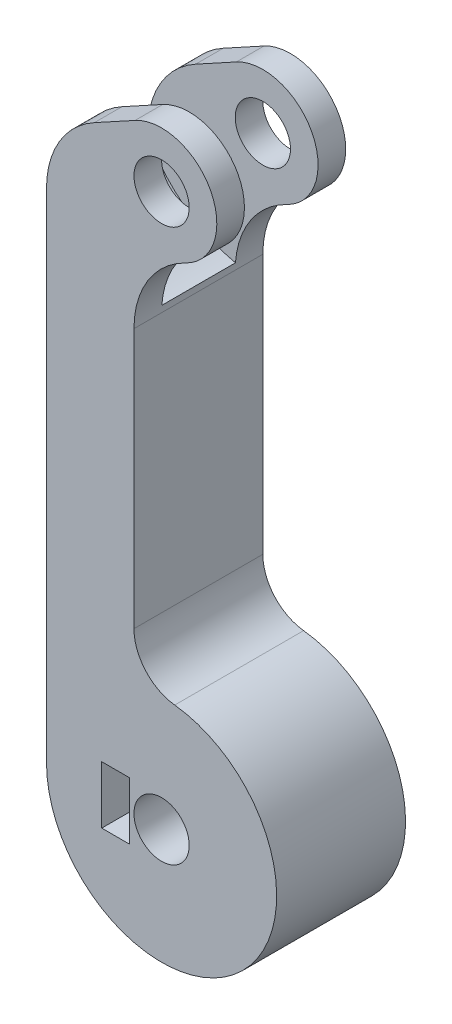
ISO-10303-21;
HEADER;
FILE_DESCRIPTION(('STEP AP214'),'2;1');
FILE_NAME('part.step','',(''),(''),'','','');
FILE_SCHEMA(('AUTOMOTIVE_DESIGN { 1 0 10303 214 1 1 1 1 }'));
ENDSEC;
DATA;
#1=APPLICATION_CONTEXT('core data for automotive mechanical design processes');
#2=APPLICATION_PROTOCOL_DEFINITION('international standard','automotive_design',2000,#1);
#3=PRODUCT_CONTEXT('',#1,'mechanical');
#4=PRODUCT('Part','Part','',(#3));
#5=PRODUCT_RELATED_PRODUCT_CATEGORY('part','',(#4));
#6=PRODUCT_DEFINITION_FORMATION('','',#4);
#7=PRODUCT_DEFINITION_CONTEXT('part definition',#1,'design');
#8=PRODUCT_DEFINITION('design','',#6,#7);
#9=PRODUCT_DEFINITION_SHAPE('','',#8);
#10=(LENGTH_UNIT() NAMED_UNIT(*) SI_UNIT(.MILLI.,.METRE.));
#11=(NAMED_UNIT(*) PLANE_ANGLE_UNIT() SI_UNIT($,.RADIAN.));
#12=(NAMED_UNIT(*) SI_UNIT($,.STERADIAN.) SOLID_ANGLE_UNIT());
#13=UNCERTAINTY_MEASURE_WITH_UNIT(LENGTH_MEASURE(1.E-05),#10,'distance_accuracy_value','');
#14=(GEOMETRIC_REPRESENTATION_CONTEXT(3) GLOBAL_UNCERTAINTY_ASSIGNED_CONTEXT((#13)) GLOBAL_UNIT_ASSIGNED_CONTEXT((#10,
#11,#12)) REPRESENTATION_CONTEXT('',''));
#15=CARTESIAN_POINT('',(0.,0.,0.));
#16=DIRECTION('',(0.,0.,1.));
#17=DIRECTION('',(1.,0.,0.));
#18=AXIS2_PLACEMENT_3D('',#15,#16,#17);
#19=CARTESIAN_POINT('',(-2.5,0.,7.));
#20=DIRECTION('',(-1.,0.,0.));
#21=DIRECTION('',(0.,-1.,0.));
#22=AXIS2_PLACEMENT_3D('',#19,#20,#21);
#23=CYLINDRICAL_SURFACE('',#22,1.5);
#24=CARTESIAN_POINT('',(-3.,0.,8.5));
#25=CARTESIAN_POINT('',(-2.99999570107562,-0.0788579444268502,8.49999504652421));
#26=CARTESIAN_POINT('',(-2.99685736529635,-0.157809899546344,8.49374489031842));
#27=CARTESIAN_POINT('',(-2.98461234055736,-0.313380352903344,8.46902067948769));
#28=CARTESIAN_POINT('',(-2.97549431743379,-0.389994130070444,8.45052341050328));
#29=CARTESIAN_POINT('',(-2.95224419105063,-0.538400317320674,8.40220928707506));
#30=CARTESIAN_POINT('',(-2.93813158766306,-0.61021020440872,8.37243642362805));
#31=CARTESIAN_POINT('',(-2.90618664773642,-0.747708925209899,8.30264406795252));
#32=CARTESIAN_POINT('',(-2.88835460450288,-0.813398240985089,8.2626253836267));
#33=CARTESIAN_POINT('',(-2.84934387387093,-0.941261726642864,8.17072412577207));
#34=CARTESIAN_POINT('',(-2.82802798691306,-1.00298281668316,8.11827028114054));
#35=CARTESIAN_POINT('',(-2.78489955370114,-1.11716916730047,8.00421778112944));
#36=CARTESIAN_POINT('',(-2.76308664313552,-1.16962737466015,7.94261222234134));
#37=CARTESIAN_POINT('',(-2.71948426796021,-1.26787800067542,7.80627497571493));
#38=CARTESIAN_POINT('',(-2.69782780455198,-1.31283800332746,7.73089585248113));
#39=CARTESIAN_POINT('',(-2.65928968158481,-1.38925234033604,7.57244899602068));
#40=CARTESIAN_POINT('',(-2.64240461410484,-1.4207163224495,7.48938680691588));
#41=CARTESIAN_POINT('',(-2.61686800556713,-1.46719866328288,7.32300234186712));
#42=CARTESIAN_POINT('',(-2.6077840737557,-1.48308878562066,7.23999332189891));
#43=CARTESIAN_POINT('',(-2.59772834922792,-1.50064048996327,7.07203174333078));
#44=CARTESIAN_POINT('',(-2.59674854014932,-1.50231613255961,6.98708118869327));
#45=CARTESIAN_POINT('',(-2.60266395385873,-1.49203093075844,6.82857096352695));
#46=CARTESIAN_POINT('',(-2.6086314549302,-1.48167683930523,6.75486395316543));
#47=CARTESIAN_POINT('',(-2.62614343100775,-1.4504097735854,6.61041713594044));
#48=CARTESIAN_POINT('',(-2.63768968247664,-1.42949343584648,6.53967828204203));
#49=CARTESIAN_POINT('',(-2.66531214619112,-1.37731467057901,6.40115630115151));
#50=CARTESIAN_POINT('',(-2.68148760995998,-1.34582260067399,6.33348040182132));
#51=CARTESIAN_POINT('',(-2.71655106422106,-1.273562531502,6.20404856111499));
#52=CARTESIAN_POINT('',(-2.73544027170286,-1.2327903657187,6.14229529659987));
#53=CARTESIAN_POINT('',(-2.77669736854929,-1.13709908236918,6.01821812088516));
#54=CARTESIAN_POINT('',(-2.79920265355119,-1.08104168755392,5.95681468963576));
#55=CARTESIAN_POINT('',(-2.84321434950611,-0.95933336811206,5.84389687211365));
#56=CARTESIAN_POINT('',(-2.86472027938201,-0.893677884861428,5.79238721194918));
#57=CARTESIAN_POINT('',(-2.90552980924446,-0.750774758747773,5.69847150845541));
#58=CARTESIAN_POINT('',(-2.92468476243011,-0.673130387399113,5.65659929133139));
#59=CARTESIAN_POINT('',(-2.95736821681863,-0.510699323233195,5.58685445643549));
#60=CARTESIAN_POINT('',(-2.9709011841533,-0.425918364397914,5.55897072247725));
#61=CARTESIAN_POINT('',(-2.98986500612153,-0.259149737491054,5.52028689442499));
#62=CARTESIAN_POINT('',(-2.99587407451965,-0.17751229582249,5.50826314637983));
#63=CARTESIAN_POINT('',(-3.00109520188655,-0.0131693999240282,5.49780290329827));
#64=CARTESIAN_POINT('',(-3.00031048081978,0.0695355298048626,5.4993599715408));
#65=CARTESIAN_POINT('',(-2.99236788380152,0.22684945797898,5.51531003262812));
#66=CARTESIAN_POINT('',(-2.98570868532252,0.301589112074895,5.52869879909499));
#67=CARTESIAN_POINT('',(-2.9673325697226,0.447610338452911,5.56635710784268));
#68=CARTESIAN_POINT('',(-2.95561509501618,0.51889152853663,5.59062784968024));
#69=CARTESIAN_POINT('',(-2.92776377120382,0.658332912674358,5.64999769964955));
#70=CARTESIAN_POINT('',(-2.91151322654446,0.726345595508704,5.68538657517443));
#71=CARTESIAN_POINT('',(-2.87615961476126,0.855692042548907,5.76566130346985));
#72=CARTESIAN_POINT('',(-2.85705533350407,0.917022944664887,5.81055120189309));
#73=CARTESIAN_POINT('',(-2.81562332004297,1.03765153393382,5.91364063799608));
#74=CARTESIAN_POINT('',(-2.79316327265249,1.09615811672854,5.97271430266772));
#75=CARTESIAN_POINT('',(-2.7489358741323,1.20278448167828,6.09988772691659));
#76=CARTESIAN_POINT('',(-2.72716901100071,1.25089707856781,6.16799367827188));
#77=CARTESIAN_POINT('',(-2.68576788309734,1.33756187171853,6.31546548125946));
#78=CARTESIAN_POINT('',(-2.66628794383591,1.37553824370037,6.39521689914172));
#79=CARTESIAN_POINT('',(-2.63361108441202,1.43712423890206,6.56126510136245));
#80=CARTESIAN_POINT('',(-2.62040607332625,1.46075237380052,6.64755328970034));
#81=CARTESIAN_POINT('',(-2.60342251538703,1.49079253120031,6.81536533432706));
#82=CARTESIAN_POINT('',(-2.59886075197597,1.49863949460818,6.89655138015286));
#83=CARTESIAN_POINT('',(-2.59748031962405,1.5010337315643,7.05917060074679));
#84=CARTESIAN_POINT('',(-2.60065829439585,1.49558676993486,7.14060365310679));
#85=CARTESIAN_POINT('',(-2.61356793076615,1.47288918838996,7.29322525230016));
#86=CARTESIAN_POINT('',(-2.62264641723988,1.45681247151455,7.36465070521711));
#87=CARTESIAN_POINT('',(-2.64556524281479,1.41476303733662,7.50371217913655));
#88=CARTESIAN_POINT('',(-2.65940711354503,1.38878713673988,7.57134697313805));
#89=CARTESIAN_POINT('',(-2.69142795546804,1.32572361795085,7.70593727647981));
#90=CARTESIAN_POINT('',(-2.70983583593881,1.28800670672355,7.77254185274354));
#91=CARTESIAN_POINT('',(-2.74852997452291,1.20322645745609,7.89891180427189));
#92=CARTESIAN_POINT('',(-2.76881720693416,1.15615825686234,7.95867359578167));
#93=CARTESIAN_POINT('',(-2.81193484737138,1.04730498999206,8.07721297353201));
#94=CARTESIAN_POINT('',(-2.83477474959942,0.984426634495891,8.13498865352544));
#95=CARTESIAN_POINT('',(-2.87816628389896,0.849232209349794,8.2393944751529));
#96=CARTESIAN_POINT('',(-2.89871667939293,0.776911084957794,8.28601860920486));
#97=CARTESIAN_POINT('',(-2.93547014349806,0.623897395174417,8.3668545440681));
#98=CARTESIAN_POINT('',(-2.95164144740899,0.543149255665094,8.4009762538547));
#99=CARTESIAN_POINT('',(-2.9775201194848,0.376113151707129,8.45471225163611));
#100=CARTESIAN_POINT('',(-2.98724585044602,0.289841699383649,8.47436777020857));
#101=CARTESIAN_POINT('',(-2.99543192870217,0.168902919736342,8.49084611662861));
#102=CARTESIAN_POINT('',(-2.99714048010376,0.135242819162346,8.49427396129951));
#103=CARTESIAN_POINT('',(-2.99942545465223,0.0677275977076369,8.49885199827113));
#104=CARTESIAN_POINT('',(-3.00000184655071,0.0338724714699424,8.50000212770531));
#105=CARTESIAN_POINT('',(-3.,0.,8.5));
#106=B_SPLINE_CURVE_WITH_KNOTS('',3,(#24,#25,#26,#27,#28,#29,#30,#31,#32,#33,#34,#35,#36,#37,
#38,#39,#40,#41,#42,#43,#44,#45,#46,#47,#48,#49,#50,#51,#52,#53,#54,#55,#56,#57,#58,#59,#60,#61,
#62,#63,#64,#65,#66,#67,#68,#69,#70,#71,#72,#73,#74,#75,#76,#77,#78,#79,#80,#81,#82,#83,#84,#85,
#86,#87,#88,#89,#90,#91,#92,#93,#94,#95,#96,#97,#98,#99,#100,#101,#102,#103,#104,#105),
.UNSPECIFIED.,.T.,.F.,(4,2,2,2,2,2,2,2,2,2,2,2,2,2,2,2,2,2,2,2,2,2,2,2,2,2,2,2,2,2,2,2,2,2,2,2,
2,2,2,2,4),(0.,0.236436386130439,0.473322224563796,0.709293233238449,0.945245640872352,
1.19547263807713,1.44588935648105,1.71572589646129,1.98536921847421,2.23887018210344,
2.49212035993531,2.71508568613981,2.93812205888518,3.16635360252731,3.39468781890333,
3.65197412000818,3.90938301898029,4.17874533321661,4.44789325368419,4.69474935707018,
4.94148846767214,5.16910359759183,5.39674382446397,5.63089284041848,5.86514176122509,
6.12239415966628,6.37982382923148,6.64972023242588,6.91926767918176,7.1629396125457,
7.40650589797017,7.62686895373283,7.84730293182526,8.08254685170431,8.31791341715446,
8.58187864135757,8.84598575071869,9.1119602049529,9.37717362931724,9.47872920200875,
9.58028757766599),.UNSPECIFIED.);
#107=CARTESIAN_POINT('',(-3.,0.,8.5));
#108=VERTEX_POINT('',#107);
#109=EDGE_CURVE('E223',#108,#108,#106,.T.);
#110=ORIENTED_EDGE('',*,*,#109,.T.);
#111=EDGE_LOOP('',(#110));
#112=FACE_BOUND('',#111,.T.);
#113=CARTESIAN_POINT('',(-3.5,0.,7.));
#114=DIRECTION('',(-1.,0.,0.));
#115=DIRECTION('',(0.,0.,1.));
#116=AXIS2_PLACEMENT_3D('',#113,#114,#115);
#117=CIRCLE('',#116,1.5);
#118=CARTESIAN_POINT('',(-3.5,0.,8.5));
#119=VERTEX_POINT('',#118);
#120=EDGE_CURVE('E202',#119,#119,#117,.F.);
#121=ORIENTED_EDGE('',*,*,#120,.F.);
#122=EDGE_LOOP('',(#121));
#123=FACE_BOUND('',#122,.T.);
#124=ADVANCED_FACE('F35',(#112,#123),#23,.F.);
#125=CARTESIAN_POINT('',(0.,0.,14.));
#126=DIRECTION('',(0.,0.,1.));
#127=DIRECTION('',(1.,0.,0.));
#128=AXIS2_PLACEMENT_3D('',#125,#126,#127);
#129=PLANE('',#128);
#130=DIRECTION('',(0.877268487978452,0.48,0.));
#131=VECTOR('',#130,1.);
#132=CARTESIAN_POINT('',(-28.1453324537794,51.4396109278707,14.));
#133=LINE('',#132,#131);
#134=CARTESIAN_POINT('',(-7.3,62.8451950961463,14.));
#135=VERTEX_POINT('',#134);
#136=CARTESIAN_POINT('',(-2.88,65.2636109278707,14.));
#137=VERTEX_POINT('',#136);
#138=EDGE_CURVE('E261',#135,#137,#133,.T.);
#139=ORIENTED_EDGE('',*,*,#138,.F.);
#140=CARTESIAN_POINT('',(-2.5,54.0725102163618,14.));
#141=DIRECTION('',(0.,0.,1.));
#142=DIRECTION('',(1.,0.,0.));
#143=AXIS2_PLACEMENT_3D('',#140,#141,#142);
#144=CIRCLE('',#143,10.);
#145=CARTESIAN_POINT('',(-12.5,54.0725102163618,14.));
#146=VERTEX_POINT('',#145);
#147=EDGE_CURVE('E308',#135,#146,#144,.T.);
#148=ORIENTED_EDGE('',*,*,#147,.T.);
#149=DIRECTION('',(0.,-1.,0.));
#150=VECTOR('',#149,1.);
#151=CARTESIAN_POINT('',(-12.5,0.,14.));
#152=LINE('',#151,#150);
#153=CARTESIAN_POINT('',(-12.5,0.,14.));
#154=VERTEX_POINT('',#153);
#155=EDGE_CURVE('E264',#146,#154,#152,.T.);
#156=ORIENTED_EDGE('',*,*,#155,.T.);
#157=CARTESIAN_POINT('',(0.,0.,14.));
#158=DIRECTION('',(0.,0.,1.));
#159=DIRECTION('',(1.,0.,0.));
#160=AXIS2_PLACEMENT_3D('',#157,#158,#159);
#161=CIRCLE('',#160,12.5);
#162=CARTESIAN_POINT('',(1.42857142857143,12.4180990362241,14.));
#163=VERTEX_POINT('',#162);
#164=EDGE_CURVE('E253',#154,#163,#161,.T.);
#165=ORIENTED_EDGE('',*,*,#164,.T.);
#166=CARTESIAN_POINT('',(2.,17.3853386507137,14.));
#167=DIRECTION('',(0.,0.,1.));
#168=DIRECTION('',(1.,0.,0.));
#169=AXIS2_PLACEMENT_3D('',#166,#167,#168);
#170=CIRCLE('',#169,5.);
#171=CARTESIAN_POINT('',(-3.,17.3853386507137,14.));
#172=VERTEX_POINT('',#171);
#173=EDGE_CURVE('E329',#163,#172,#170,.F.);
#174=ORIENTED_EDGE('',*,*,#173,.T.);
#175=DIRECTION('',(0.,1.,0.));
#176=VECTOR('',#175,1.);
#177=CARTESIAN_POINT('',(-3.,0.,14.));
#178=LINE('',#177,#176);
#179=CARTESIAN_POINT('',(-3.,45.6125054300618,14.));
#180=VERTEX_POINT('',#179);
#181=EDGE_CURVE('E256',#172,#180,#178,.T.);
#182=ORIENTED_EDGE('',*,*,#181,.T.);
#183=CARTESIAN_POINT('',(7.,45.6125054300618,14.));
#184=DIRECTION('',(0.,0.,1.));
#185=DIRECTION('',(1.,0.,0.));
#186=AXIS2_PLACEMENT_3D('',#183,#184,#185);
#187=CIRCLE('',#186,10.);
#188=CARTESIAN_POINT('',(2.625,54.6046895362732,14.));
#189=VERTEX_POINT('',#188);
#190=EDGE_CURVE('E320',#180,#189,#187,.F.);
#191=ORIENTED_EDGE('',*,*,#190,.T.);
#192=CARTESIAN_POINT('',(0.,60.,14.));
#193=DIRECTION('',(0.,0.,1.));
#194=DIRECTION('',(1.,0.,0.));
#195=AXIS2_PLACEMENT_3D('',#192,#193,#194);
#196=CIRCLE('',#195,6.);
#197=EDGE_CURVE('E259',#189,#137,#196,.T.);
#198=ORIENTED_EDGE('',*,*,#197,.T.);
#199=EDGE_LOOP('',(#139,#148,#156,#165,#174,#182,#191,#198));
#200=FACE_BOUND('',#199,.T.);
#201=CARTESIAN_POINT('',(0.,60.,14.));
#202=DIRECTION('',(0.,0.,1.));
#203=DIRECTION('',(1.,0.,0.));
#204=AXIS2_PLACEMENT_3D('',#201,#202,#203);
#205=CIRCLE('',#204,3.);
#206=CARTESIAN_POINT('',(3.,60.,14.));
#207=VERTEX_POINT('',#206);
#208=EDGE_CURVE('E266',#207,#207,#205,.T.);
#209=ORIENTED_EDGE('',*,*,#208,.F.);
#210=EDGE_LOOP('',(#209));
#211=FACE_BOUND('',#210,.T.);
#212=CARTESIAN_POINT('',(0.,0.,14.));
#213=DIRECTION('',(0.,0.,1.));
#214=DIRECTION('',(1.,0.,0.));
#215=AXIS2_PLACEMENT_3D('',#212,#213,#214);
#216=CIRCLE('',#215,3.);
#217=CARTESIAN_POINT('',(3.,0.,14.));
#218=VERTEX_POINT('',#217);
#219=EDGE_CURVE('E269',#218,#218,#216,.T.);
#220=ORIENTED_EDGE('',*,*,#219,.F.);
#221=EDGE_LOOP('',(#220));
#222=FACE_BOUND('',#221,.T.);
#223=DIRECTION('',(-1.,0.,0.));
#224=VECTOR('',#223,1.);
#225=CARTESIAN_POINT('',(-3.5,3.12500000000003,14.));
#226=LINE('',#225,#224);
#227=CARTESIAN_POINT('',(-3.5,3.12500000000003,14.));
#228=VERTEX_POINT('',#227);
#229=CARTESIAN_POINT('',(-6.5,3.12500000000003,14.));
#230=VERTEX_POINT('',#229);
#231=EDGE_CURVE('E194',#228,#230,#226,.T.);
#232=ORIENTED_EDGE('',*,*,#231,.F.);
#233=DIRECTION('',(0.,-1.,0.));
#234=VECTOR('',#233,1.);
#235=CARTESIAN_POINT('',(-3.5,0.,14.));
#236=LINE('',#235,#234);
#237=CARTESIAN_POINT('',(-3.5,-3.12500000000003,14.));
#238=VERTEX_POINT('',#237);
#239=EDGE_CURVE('E178',#228,#238,#236,.T.);
#240=ORIENTED_EDGE('',*,*,#239,.T.);
#241=DIRECTION('',(-1.,0.,0.));
#242=VECTOR('',#241,1.);
#243=CARTESIAN_POINT('',(-3.5,-3.12500000000003,14.));
#244=LINE('',#243,#242);
#245=CARTESIAN_POINT('',(-6.5,-3.12500000000003,14.));
#246=VERTEX_POINT('',#245);
#247=EDGE_CURVE('E215',#238,#246,#244,.T.);
#248=ORIENTED_EDGE('',*,*,#247,.T.);
#249=DIRECTION('',(0.,-1.,0.));
#250=VECTOR('',#249,1.);
#251=CARTESIAN_POINT('',(-6.5,0.,14.));
#252=LINE('',#251,#250);
#253=EDGE_CURVE('E201',#230,#246,#252,.T.);
#254=ORIENTED_EDGE('',*,*,#253,.F.);
#255=EDGE_LOOP('',(#232,#240,#248,#254));
#256=FACE_BOUND('',#255,.T.);
#257=ADVANCED_FACE('F200',(#200,#211,#222,#256),#129,.T.);
#258=CARTESIAN_POINT('',(-6.5,0.,7.));
#259=DIRECTION('',(-1.,0.,0.));
#260=DIRECTION('',(0.,0.,1.));
#261=AXIS2_PLACEMENT_3D('',#258,#259,#260);
#262=CIRCLE('',#261,1.5);
#263=CARTESIAN_POINT('',(-6.5,0.,8.5));
#264=VERTEX_POINT('',#263);
#265=EDGE_CURVE('E190',#264,#264,#262,.F.);
#266=ORIENTED_EDGE('',*,*,#265,.T.);
#267=EDGE_LOOP('',(#266));
#268=FACE_BOUND('',#267,.T.);
#269=CARTESIAN_POINT('',(-9.5,0.,7.));
#270=DIRECTION('',(-1.,0.,0.));
#271=DIRECTION('',(0.,-1.,0.));
#272=AXIS2_PLACEMENT_3D('',#269,#270,#271);
#273=CIRCLE('',#272,1.5);
#274=CARTESIAN_POINT('',(-9.5,-1.5,7.));
#275=VERTEX_POINT('',#274);
#276=EDGE_CURVE('E213',#275,#275,#273,.F.);
#277=ORIENTED_EDGE('',*,*,#276,.F.);
#278=EDGE_LOOP('',(#277));
#279=FACE_BOUND('',#278,.T.);
#280=ADVANCED_FACE('F347',(#268,#279),#23,.F.);
#281=CARTESIAN_POINT('',(0.,60.,14.));
#282=DIRECTION('',(0.,0.,-1.));
#283=DIRECTION('',(-1.,0.,0.));
#284=AXIS2_PLACEMENT_3D('',#281,#282,#283);
#285=CYLINDRICAL_SURFACE('',#284,6.);
#286=CARTESIAN_POINT('',(0.,60.,3.));
#287=DIRECTION('',(0.,0.,1.));
#288=DIRECTION('',(1.,0.,0.));
#289=AXIS2_PLACEMENT_3D('',#286,#287,#288);
#290=CIRCLE('',#289,6.);
#291=CARTESIAN_POINT('',(2.625,54.6046895362732,3.));
#292=VERTEX_POINT('',#291);
#293=CARTESIAN_POINT('',(-2.88,65.2636109278707,3.));
#294=VERTEX_POINT('',#293);
#295=EDGE_CURVE('E236',#292,#294,#290,.T.);
#296=ORIENTED_EDGE('',*,*,#295,.F.);
#297=DIRECTION('',(0.,0.,-1.));
#298=VECTOR('',#297,1.);
#299=CARTESIAN_POINT('',(2.625,54.6046895362732,14.));
#300=LINE('',#299,#298);
#301=CARTESIAN_POINT('',(2.625,54.6046895362732,0.));
#302=VERTEX_POINT('',#301);
#303=EDGE_CURVE('E310',#292,#302,#300,.T.);
#304=ORIENTED_EDGE('',*,*,#303,.T.);
#305=CARTESIAN_POINT('',(0.,60.,0.));
#306=DIRECTION('',(0.,0.,1.));
#307=DIRECTION('',(1.,0.,0.));
#308=AXIS2_PLACEMENT_3D('',#305,#306,#307);
#309=CIRCLE('',#308,6.);
#310=CARTESIAN_POINT('',(-2.88,65.2636109278707,0.));
#311=VERTEX_POINT('',#310);
#312=EDGE_CURVE('E277',#302,#311,#309,.T.);
#313=ORIENTED_EDGE('',*,*,#312,.T.);
#314=DIRECTION('',(0.,0.,-1.));
#315=VECTOR('',#314,1.);
#316=CARTESIAN_POINT('',(-2.88,65.2636109278707,14.));
#317=LINE('',#316,#315);
#318=EDGE_CURVE('E294',#294,#311,#317,.T.);
#319=ORIENTED_EDGE('',*,*,#318,.F.);
#320=EDGE_LOOP('',(#296,#304,#313,#319));
#321=FACE_BOUND('',#320,.T.);
#322=ADVANCED_FACE('F351',(#321),#285,.T.);
#323=CARTESIAN_POINT('',(-28.1453324537794,51.4396109278707,14.));
#324=DIRECTION('',(-0.48,0.877268487978452,0.));
#325=DIRECTION('',(-0.877268487978452,-0.48,0.));
#326=AXIS2_PLACEMENT_3D('',#323,#324,#325);
#327=PLANE('',#326);
#328=DIRECTION('',(0.,0.,-1.));
#329=VECTOR('',#328,1.);
#330=CARTESIAN_POINT('',(-7.3,62.8451950961463,14.));
#331=LINE('',#330,#329);
#332=CARTESIAN_POINT('',(-7.3,62.8451950961463,0.));
#333=VERTEX_POINT('',#332);
#334=CARTESIAN_POINT('',(-7.29999999999999,62.8451950961463,3.));
#335=VERTEX_POINT('',#334);
#336=EDGE_CURVE('E305',#333,#335,#331,.F.);
#337=ORIENTED_EDGE('',*,*,#336,.T.);
#338=DIRECTION('',(0.877268487978452,0.48,0.));
#339=VECTOR('',#338,1.);
#340=CARTESIAN_POINT('',(-28.1453324537794,51.4396109278707,3.));
#341=LINE('',#340,#339);
#342=EDGE_CURVE('E238',#335,#294,#341,.T.);
#343=ORIENTED_EDGE('',*,*,#342,.T.);
#344=ORIENTED_EDGE('',*,*,#318,.T.);
#345=DIRECTION('',(0.877268487978452,0.48,0.));
#346=VECTOR('',#345,1.);
#347=CARTESIAN_POINT('',(-28.1453324537794,51.4396109278707,0.));
#348=LINE('',#347,#346);
#349=EDGE_CURVE('E280',#333,#311,#348,.T.);
#350=ORIENTED_EDGE('',*,*,#349,.F.);
#351=EDGE_LOOP('',(#337,#343,#344,#350));
#352=FACE_BOUND('',#351,.T.);
#353=ADVANCED_FACE('F565',(#352),#327,.T.);
#354=CARTESIAN_POINT('',(0.,60.,14.));
#355=DIRECTION('',(0.,0.,-1.));
#356=DIRECTION('',(-1.,0.,0.));
#357=AXIS2_PLACEMENT_3D('',#354,#355,#356);
#358=CYLINDRICAL_SURFACE('',#357,3.);
#359=CARTESIAN_POINT('',(0.,60.,0.));
#360=DIRECTION('',(0.,0.,1.));
#361=DIRECTION('',(1.,0.,0.));
#362=AXIS2_PLACEMENT_3D('',#359,#360,#361);
#363=CIRCLE('',#362,3.);
#364=CARTESIAN_POINT('',(3.,60.,0.));
#365=VERTEX_POINT('',#364);
#366=EDGE_CURVE('E286',#365,#365,#363,.T.);
#367=ORIENTED_EDGE('',*,*,#366,.F.);
#368=EDGE_LOOP('',(#367));
#369=FACE_BOUND('',#368,.T.);
#370=CARTESIAN_POINT('',(0.,60.,3.));
#371=DIRECTION('',(0.,0.,1.));
#372=DIRECTION('',(1.,0.,0.));
#373=AXIS2_PLACEMENT_3D('',#370,#371,#372);
#374=CIRCLE('',#373,3.);
#375=CARTESIAN_POINT('',(3.,60.,3.));
#376=VERTEX_POINT('',#375);
#377=EDGE_CURVE('E246',#376,#376,#374,.T.);
#378=ORIENTED_EDGE('',*,*,#377,.T.);
#379=EDGE_LOOP('',(#378));
#380=FACE_BOUND('',#379,.T.);
#381=ADVANCED_FACE('F553',(#369,#380),#358,.F.);
#382=CARTESIAN_POINT('',(-12.5,0.,14.));
#383=DIRECTION('',(1.,0.,0.));
#384=DIRECTION('',(0.,1.,0.));
#385=AXIS2_PLACEMENT_3D('',#382,#383,#384);
#386=PLANE('',#385);
#387=DIRECTION('',(0.,0.,-1.));
#388=VECTOR('',#387,1.);
#389=CARTESIAN_POINT('',(-12.5,0.,14.));
#390=LINE('',#389,#388);
#391=CARTESIAN_POINT('',(-12.5,0.,2.));
#392=VERTEX_POINT('',#391);
#393=CARTESIAN_POINT('',(-12.5,0.,0.));
#394=VERTEX_POINT('',#393);
#395=EDGE_CURVE('E272',#392,#394,#390,.T.);
#396=ORIENTED_EDGE('',*,*,#395,.F.);
#397=CARTESIAN_POINT('',(-12.5,0.,7.));
#398=DIRECTION('',(-1.,0.,0.));
#399=DIRECTION('',(0.,-1.,0.));
#400=AXIS2_PLACEMENT_3D('',#397,#398,#399);
#401=CIRCLE('',#400,5.);
#402=CARTESIAN_POINT('',(-12.5,0.,12.));
#403=VERTEX_POINT('',#402);
#404=EDGE_CURVE('E62',#403,#392,#401,.T.);
#405=ORIENTED_EDGE('',*,*,#404,.F.);
#406=EDGE_CURVE('E291',#154,#403,#390,.T.);
#407=ORIENTED_EDGE('',*,*,#406,.F.);
#408=ORIENTED_EDGE('',*,*,#155,.F.);
#409=DIRECTION('',(0.,0.,-1.));
#410=VECTOR('',#409,1.);
#411=CARTESIAN_POINT('',(-12.5,54.0725102163618,0.));
#412=LINE('',#411,#410);
#413=CARTESIAN_POINT('',(-12.5,54.0725102163618,11.));
#414=VERTEX_POINT('',#413);
#415=EDGE_CURVE('E299',#146,#414,#412,.T.);
#416=ORIENTED_EDGE('',*,*,#415,.T.);
#417=DIRECTION('',(0.,-1.,0.));
#418=VECTOR('',#417,1.);
#419=CARTESIAN_POINT('',(-12.5,0.,11.));
#420=LINE('',#419,#418);
#421=CARTESIAN_POINT('',(-12.5,53.6952398935408,11.));
#422=VERTEX_POINT('',#421);
#423=EDGE_CURVE('E230',#414,#422,#420,.T.);
#424=ORIENTED_EDGE('',*,*,#423,.T.);
#425=DIRECTION('',(0.,0.,1.));
#426=VECTOR('',#425,1.);
#427=CARTESIAN_POINT('',(-12.5,53.6952398935408,3.));
#428=LINE('',#427,#426);
#429=CARTESIAN_POINT('',(-12.5,53.6952398935408,3.));
#430=VERTEX_POINT('',#429);
#431=EDGE_CURVE('E249',#422,#430,#428,.F.);
#432=ORIENTED_EDGE('',*,*,#431,.T.);
#433=DIRECTION('',(0.,-1.,0.));
#434=VECTOR('',#433,1.);
#435=CARTESIAN_POINT('',(-12.5,0.,3.));
#436=LINE('',#435,#434);
#437=CARTESIAN_POINT('',(-12.5,54.0725102163618,3.));
#438=VERTEX_POINT('',#437);
#439=EDGE_CURVE('E244',#438,#430,#436,.T.);
#440=ORIENTED_EDGE('',*,*,#439,.F.);
#441=CARTESIAN_POINT('',(-12.5,54.0725102163618,0.));
#442=VERTEX_POINT('',#441);
#443=EDGE_CURVE('E298',#438,#442,#412,.T.);
#444=ORIENTED_EDGE('',*,*,#443,.T.);
#445=DIRECTION('',(0.,-1.,0.));
#446=VECTOR('',#445,1.);
#447=CARTESIAN_POINT('',(-12.5,0.,0.));
#448=LINE('',#447,#446);
#449=EDGE_CURVE('E283',#442,#394,#448,.T.);
#450=ORIENTED_EDGE('',*,*,#449,.T.);
#451=EDGE_LOOP('',(#396,#405,#407,#408,#416,#424,#432,#440,#444,#450));
#452=FACE_BOUND('',#451,.T.);
#453=ADVANCED_FACE('F596',(#452),#386,.F.);
#454=CARTESIAN_POINT('',(-2.5,54.0725102163618,14.));
#455=DIRECTION('',(0.,0.,1.));
#456=DIRECTION('',(1.,0.,0.));
#457=AXIS2_PLACEMENT_3D('',#454,#455,#456);
#458=CYLINDRICAL_SURFACE('',#457,10.);
#459=ORIENTED_EDGE('',*,*,#443,.F.);
#460=CARTESIAN_POINT('',(-2.5,54.0725102163618,3.));
#461=DIRECTION('',(0.,0.,1.));
#462=DIRECTION('',(1.,0.,0.));
#463=AXIS2_PLACEMENT_3D('',#460,#461,#462);
#464=CIRCLE('',#463,10.);
#465=EDGE_CURVE('E241',#438,#335,#464,.F.);
#466=ORIENTED_EDGE('',*,*,#465,.T.);
#467=ORIENTED_EDGE('',*,*,#336,.F.);
#468=CARTESIAN_POINT('',(-2.5,54.0725102163618,0.));
#469=DIRECTION('',(0.,0.,1.));
#470=DIRECTION('',(1.,0.,0.));
#471=AXIS2_PLACEMENT_3D('',#468,#469,#470);
#472=CIRCLE('',#471,10.);
#473=EDGE_CURVE('E302',#442,#333,#472,.F.);
#474=ORIENTED_EDGE('',*,*,#473,.F.);
#475=EDGE_LOOP('',(#459,#466,#467,#474));
#476=FACE_BOUND('',#475,.T.);
#477=ADVANCED_FACE('F380',(#476),#458,.T.);
#478=CARTESIAN_POINT('',(7.,45.6125054300618,14.));
#479=DIRECTION('',(0.,0.,-1.));
#480=DIRECTION('',(-1.,0.,0.));
#481=AXIS2_PLACEMENT_3D('',#478,#479,#480);
#482=CYLINDRICAL_SURFACE('',#481,10.);
#483=CARTESIAN_POINT('',(7.,45.6125054300618,3.));
#484=DIRECTION('',(0.,0.,1.));
#485=DIRECTION('',(1.,0.,0.));
#486=AXIS2_PLACEMENT_3D('',#483,#484,#485);
#487=CIRCLE('',#486,10.);
#488=CARTESIAN_POINT('',(-2.9749598714857,46.3197363416106,3.));
#489=VERTEX_POINT('',#488);
#490=EDGE_CURVE('E48',#489,#292,#487,.F.);
#491=ORIENTED_EDGE('',*,*,#490,.F.);
#492=DIRECTION('',(0.,0.,1.));
#493=VECTOR('',#492,1.);
#494=CARTESIAN_POINT('',(-2.9749598714857,46.3197363416106,7.));
#495=LINE('',#494,#493);
#496=CARTESIAN_POINT('',(-2.9749598714857,46.3197363416106,11.));
#497=VERTEX_POINT('',#496);
#498=EDGE_CURVE('E334',#489,#497,#495,.T.);
#499=ORIENTED_EDGE('',*,*,#498,.T.);
#500=CARTESIAN_POINT('',(7.,45.6125054300618,11.));
#501=DIRECTION('',(0.,0.,1.));
#502=DIRECTION('',(1.,0.,0.));
#503=AXIS2_PLACEMENT_3D('',#500,#501,#502);
#504=CIRCLE('',#503,10.);
#505=CARTESIAN_POINT('',(2.625,54.6046895362732,11.));
#506=VERTEX_POINT('',#505);
#507=EDGE_CURVE('E331',#497,#506,#504,.F.);
#508=ORIENTED_EDGE('',*,*,#507,.T.);
#509=EDGE_CURVE('E311',#189,#506,#300,.T.);
#510=ORIENTED_EDGE('',*,*,#509,.F.);
#511=ORIENTED_EDGE('',*,*,#190,.F.);
#512=DIRECTION('',(0.,0.,1.));
#513=VECTOR('',#512,1.);
#514=CARTESIAN_POINT('',(-3.,45.6125054300618,14.));
#515=LINE('',#514,#513);
#516=CARTESIAN_POINT('',(-3.,45.6125054300618,0.));
#517=VERTEX_POINT('',#516);
#518=EDGE_CURVE('E314',#517,#180,#515,.T.);
#519=ORIENTED_EDGE('',*,*,#518,.F.);
#520=CARTESIAN_POINT('',(7.,45.6125054300618,0.));
#521=DIRECTION('',(0.,0.,1.));
#522=DIRECTION('',(1.,0.,0.));
#523=AXIS2_PLACEMENT_3D('',#520,#521,#522);
#524=CIRCLE('',#523,10.);
#525=EDGE_CURVE('E317',#302,#517,#524,.T.);
#526=ORIENTED_EDGE('',*,*,#525,.F.);
#527=ORIENTED_EDGE('',*,*,#303,.F.);
#528=EDGE_LOOP('',(#491,#499,#508,#510,#511,#519,#526,#527));
#529=FACE_BOUND('',#528,.T.);
#530=ADVANCED_FACE('F581',(#529),#482,.F.);
#531=CARTESIAN_POINT('',(0.,0.,14.));
#532=DIRECTION('',(0.,0.,-1.));
#533=DIRECTION('',(-1.,0.,0.));
#534=AXIS2_PLACEMENT_3D('',#531,#532,#533);
#535=CYLINDRICAL_SURFACE('',#534,12.5);
#536=ORIENTED_EDGE('',*,*,#406,.T.);
#537=CARTESIAN_POINT('',(-12.5,0.,12.));
#538=CARTESIAN_POINT('',(-12.500020800684,-0.134949308996274,12.0000202081202));
#539=CARTESIAN_POINT('',(-12.4978153957144,-0.269889445051977,11.9945375022852));
#540=CARTESIAN_POINT('',(-12.489104501459,-0.53871066429344,11.9727171797796));
#541=CARTESIAN_POINT('',(-12.4826002859457,-0.672592049307616,11.9563827785468));
#542=CARTESIAN_POINT('',(-12.4654733400566,-0.937880643793604,11.9130841683113));
#543=CARTESIAN_POINT('',(-12.4548648060412,-1.06929476209466,11.8861565945196));
#544=CARTESIAN_POINT('',(-12.4298142661668,-1.32919381894715,11.8219458218481));
#545=CARTESIAN_POINT('',(-12.4153721065972,-1.45767863982299,11.7846622077363));
#546=CARTESIAN_POINT('',(-12.3830371412335,-1.71074349111272,11.7001204058065));
#547=CARTESIAN_POINT('',(-12.3651475954467,-1.83532708233301,11.6528716375409));
#548=CARTESIAN_POINT('',(-12.3263603625027,-2.07995512816273,11.5487893664004));
#549=CARTESIAN_POINT('',(-12.305461551723,-2.19999786603811,11.4919522819998));
#550=CARTESIAN_POINT('',(-12.2389837385988,-2.55229640076871,11.3076579554153));
#551=CARTESIAN_POINT('',(-12.1896127431099,-2.77680181017457,11.1663909491314));
#552=CARTESIAN_POINT('',(-12.0832664924134,-3.20880030935443,10.8443958586704));
#553=CARTESIAN_POINT('',(-12.0260574468794,-3.4151671301424,10.662247568058));
#554=CARTESIAN_POINT('',(-11.9115017033706,-3.79546821071738,10.2664419108347));
#555=CARTESIAN_POINT('',(-11.8541549616113,-3.96939020702375,10.0527726843802));
#556=CARTESIAN_POINT('',(-11.7714354046385,-4.20603647838614,9.70739277182154));
#557=CARTESIAN_POINT('',(-11.7438616590436,-4.28222354403732,9.58521766855821));
#558=CARTESIAN_POINT('',(-11.6912025131309,-4.42396777333364,9.33435881417283));
#559=CARTESIAN_POINT('',(-11.6661160911756,-4.48952930836457,9.20567776835347));
#560=CARTESIAN_POINT('',(-11.6192518077079,-4.60946194967609,8.94261803683486));
#561=CARTESIAN_POINT('',(-11.5974741020936,-4.66383252871047,8.8082390830462));
#562=CARTESIAN_POINT('',(-11.5579968261789,-4.76082481749917,8.53478857434898));
#563=CARTESIAN_POINT('',(-11.540295219536,-4.80345239593476,8.39571940257148));
#564=CARTESIAN_POINT('',(-11.5103010427642,-4.8748746809749,8.12023520600168));
#565=CARTESIAN_POINT('',(-11.4978012422802,-4.90420468010106,7.98398150679508));
#566=CARTESIAN_POINT('',(-11.4775530418261,-4.95140770700266,7.70921206798286));
#567=CARTESIAN_POINT('',(-11.4698024965028,-4.96928590799763,7.57069737879456));
#568=CARTESIAN_POINT('',(-11.4593296133055,-4.99338947016272,7.29249397310081));
#569=CARTESIAN_POINT('',(-11.4566063172897,-4.99961705182375,7.15280548540847));
#570=CARTESIAN_POINT('',(-11.4562871379012,-5.00034862390723,6.87339536184991));
#571=CARTESIAN_POINT('',(-11.4586910154291,-4.99485316101917,6.73367372783325));
#572=CARTESIAN_POINT('',(-11.4681901273893,-4.97300130092477,6.4650946500387));
#573=CARTESIAN_POINT('',(-11.4749457840337,-4.95743071779699,6.33616031960835));
#574=CARTESIAN_POINT('',(-11.4925995806655,-4.9163659139183,6.08012882343619));
#575=CARTESIAN_POINT('',(-11.5034990839794,-4.89086842714742,5.95303227662596));
#576=CARTESIAN_POINT('',(-11.5291035207104,-4.83020236032039,5.70159296674975));
#577=CARTESIAN_POINT('',(-11.5438074730664,-4.7950362733804,5.57724950270114));
#578=CARTESIAN_POINT('',(-11.5765842944584,-4.7153519685607,5.33203609660907));
#579=CARTESIAN_POINT('',(-11.5946584578651,-4.67083015666429,5.21116750978904));
#580=CARTESIAN_POINT('',(-11.6539747379485,-4.52178204947661,4.85010139425016));
#581=CARTESIAN_POINT('',(-11.6997804109224,-4.40296543798373,4.61636927967778));
#582=CARTESIAN_POINT('',(-11.7984560330086,-4.13125297805196,4.17142234632085));
#583=CARTESIAN_POINT('',(-11.8513286997704,-3.97834400402712,3.96021624649368));
#584=CARTESIAN_POINT('',(-11.9631625736754,-3.62890183055985,3.54900486480799));
#585=CARTESIAN_POINT('',(-12.0222786301683,-3.42991144740135,3.35112458787171));
#586=CARTESIAN_POINT('',(-12.1364954090928,-3.00076790048644,2.99078406595519));
#587=CARTESIAN_POINT('',(-12.1915948638257,-2.77060496315566,2.82833497162943));
#588=CARTESIAN_POINT('',(-12.2673288544486,-2.40390629799307,2.61343668849912));
#589=CARTESIAN_POINT('',(-12.2916358574032,-2.2766604796445,2.54605623097672));
#590=CARTESIAN_POINT('',(-12.3370030588955,-2.01637401415009,2.42234065214828));
#591=CARTESIAN_POINT('',(-12.35806464147,-1.88333586840904,2.36600081967366));
#592=CARTESIAN_POINT('',(-12.3963064620939,-1.61253473583468,2.26496034325046));
#593=CARTESIAN_POINT('',(-12.4134907396409,-1.47477684020628,2.22024757838093));
#594=CARTESIAN_POINT('',(-12.4434913892399,-1.19551142860325,2.14286700346893));
#595=CARTESIAN_POINT('',(-12.4563096094147,-1.05400552654081,2.11019409655416));
#596=CARTESIAN_POINT('',(-12.4777045849554,-0.761202648433835,2.05593234220772));
#597=CARTESIAN_POINT('',(-12.486037678861,-0.609769523376454,2.03497819171445));
#598=CARTESIAN_POINT('',(-12.4972000952862,-0.305560981969258,2.00700142663273));
#599=CARTESIAN_POINT('',(-12.5000343505931,-0.152786892266489,1.9999663257114));
#600=CARTESIAN_POINT('',(-12.5,0.,2.));
#601=B_SPLINE_CURVE_WITH_KNOTS('',3,(#537,#538,#539,#540,#541,#542,#543,#544,#545,#546,#547,
#548,#549,#550,#551,#552,#553,#554,#555,#556,#557,#558,#559,#560,#561,#562,#563,#564,#565,#566,
#567,#568,#569,#570,#571,#572,#573,#574,#575,#576,#577,#578,#579,#580,#581,#582,#583,#584,#585,
#586,#587,#588,#589,#590,#591,#592,#593,#594,#595,#596,#597,#598,#599,#600),.UNSPECIFIED.,.F.,
.F.,(4,2,2,2,2,2,2,2,2,2,2,2,2,2,2,2,2,2,2,2,2,2,2,2,2,2,2,2,2,2,2,4),(0.,0.404704249299301,
0.809288635181336,1.21248594453223,1.61569942266767,2.01853345826748,2.42151829908201,
3.2272379512382,4.06715005376468,4.90737898548698,5.34672317980212,5.7858861648059,
6.22506983562525,6.66403362020614,7.08328204248776,7.50234094024844,7.9213199614569,
8.34027944453119,8.72996144574503,9.11977176352431,9.50948166010491,9.89934153894409,
10.6941712026682,11.489307406468,12.3458562011329,13.2026741751284,13.6402682967348,
14.077675283071,14.5146244390387,14.9513884068144,15.4099544017599,15.8681088450084),.UNSPECIFIED.);
#602=EDGE_CURVE('E11',#403,#392,#601,.T.);
#603=ORIENTED_EDGE('',*,*,#602,.T.);
#604=ORIENTED_EDGE('',*,*,#395,.T.);
#605=CARTESIAN_POINT('',(0.,0.,0.));
#606=DIRECTION('',(0.,0.,1.));
#607=DIRECTION('',(1.,0.,0.));
#608=AXIS2_PLACEMENT_3D('',#605,#606,#607);
#609=CIRCLE('',#608,12.5);
#610=CARTESIAN_POINT('',(1.42857142857143,12.4180990362241,0.));
#611=VERTEX_POINT('',#610);
#612=EDGE_CURVE('E252',#394,#611,#609,.T.);
#613=ORIENTED_EDGE('',*,*,#612,.T.);
#614=DIRECTION('',(0.,0.,-1.));
#615=VECTOR('',#614,1.);
#616=CARTESIAN_POINT('',(1.42857142857143,12.4180990362241,14.));
#617=LINE('',#616,#615);
#618=EDGE_CURVE('E325',#611,#163,#617,.F.);
#619=ORIENTED_EDGE('',*,*,#618,.T.);
#620=ORIENTED_EDGE('',*,*,#164,.F.);
#621=EDGE_LOOP('',(#536,#603,#604,#613,#619,#620));
#622=FACE_BOUND('',#621,.T.);
#623=ADVANCED_FACE('F586',(#622),#535,.T.);
#624=CARTESIAN_POINT('',(-3.,0.,14.));
#625=DIRECTION('',(-1.,0.,0.));
#626=DIRECTION('',(0.,-1.,0.));
#627=AXIS2_PLACEMENT_3D('',#624,#625,#626);
#628=PLANE('',#627);
#629=ORIENTED_EDGE('',*,*,#181,.F.);
#630=DIRECTION('',(0.,0.,1.));
#631=VECTOR('',#630,1.);
#632=CARTESIAN_POINT('',(-3.,17.3853386507137,0.));
#633=LINE('',#632,#631);
#634=CARTESIAN_POINT('',(-3.,17.3853386507137,0.));
#635=VERTEX_POINT('',#634);
#636=EDGE_CURVE('E322',#172,#635,#633,.F.);
#637=ORIENTED_EDGE('',*,*,#636,.T.);
#638=DIRECTION('',(0.,1.,0.));
#639=VECTOR('',#638,1.);
#640=CARTESIAN_POINT('',(-3.,0.,0.));
#641=LINE('',#640,#639);
#642=EDGE_CURVE('E275',#635,#517,#641,.T.);
#643=ORIENTED_EDGE('',*,*,#642,.T.);
#644=ORIENTED_EDGE('',*,*,#518,.T.);
#645=EDGE_LOOP('',(#629,#637,#643,#644));
#646=FACE_BOUND('',#645,.T.);
#647=ADVANCED_FACE('F573',(#646),#628,.F.);
#648=ORIENTED_EDGE('',*,*,#509,.T.);
#649=CARTESIAN_POINT('',(0.,60.,11.));
#650=DIRECTION('',(0.,0.,1.));
#651=DIRECTION('',(1.,0.,0.));
#652=AXIS2_PLACEMENT_3D('',#649,#650,#651);
#653=CIRCLE('',#652,6.);
#654=CARTESIAN_POINT('',(-2.88,65.2636109278707,11.));
#655=VERTEX_POINT('',#654);
#656=EDGE_CURVE('E219',#506,#655,#653,.T.);
#657=ORIENTED_EDGE('',*,*,#656,.T.);
#658=EDGE_CURVE('E295',#137,#655,#317,.T.);
#659=ORIENTED_EDGE('',*,*,#658,.F.);
#660=ORIENTED_EDGE('',*,*,#197,.F.);
#661=EDGE_LOOP('',(#648,#657,#659,#660));
#662=FACE_BOUND('',#661,.T.);
#663=ADVANCED_FACE('F562',(#662),#285,.T.);
#664=DIRECTION('',(0.877268487978452,0.48,0.));
#665=VECTOR('',#664,1.);
#666=CARTESIAN_POINT('',(-28.1453324537794,51.4396109278707,11.));
#667=LINE('',#666,#665);
#668=CARTESIAN_POINT('',(-7.29999999999999,62.8451950961463,11.));
#669=VERTEX_POINT('',#668);
#670=EDGE_CURVE('E226',#669,#655,#667,.T.);
#671=ORIENTED_EDGE('',*,*,#670,.F.);
#672=EDGE_CURVE('E304',#669,#135,#331,.F.);
#673=ORIENTED_EDGE('',*,*,#672,.T.);
#674=ORIENTED_EDGE('',*,*,#138,.T.);
#675=ORIENTED_EDGE('',*,*,#658,.T.);
#676=EDGE_LOOP('',(#671,#673,#674,#675));
#677=FACE_BOUND('',#676,.T.);
#678=ADVANCED_FACE('F551',(#677),#327,.T.);
#679=CARTESIAN_POINT('',(0.,60.,11.));
#680=DIRECTION('',(0.,0.,1.));
#681=DIRECTION('',(1.,0.,0.));
#682=AXIS2_PLACEMENT_3D('',#679,#680,#681);
#683=CIRCLE('',#682,3.);
#684=CARTESIAN_POINT('',(3.,60.,11.));
#685=VERTEX_POINT('',#684);
#686=EDGE_CURVE('E233',#685,#685,#683,.T.);
#687=ORIENTED_EDGE('',*,*,#686,.F.);
#688=EDGE_LOOP('',(#687));
#689=FACE_BOUND('',#688,.T.);
#690=ORIENTED_EDGE('',*,*,#208,.T.);
#691=EDGE_LOOP('',(#690));
#692=FACE_BOUND('',#691,.T.);
#693=ADVANCED_FACE('F382',(#689,#692),#358,.F.);
#694=CARTESIAN_POINT('',(0.,0.,14.));
#695=DIRECTION('',(0.,0.,-1.));
#696=DIRECTION('',(-1.,0.,0.));
#697=AXIS2_PLACEMENT_3D('',#694,#695,#696);
#698=CYLINDRICAL_SURFACE('',#697,3.);
#699=ORIENTED_EDGE('',*,*,#109,.F.);
#700=EDGE_LOOP('',(#699));
#701=FACE_BOUND('',#700,.T.);
#702=ORIENTED_EDGE('',*,*,#219,.T.);
#703=EDGE_LOOP('',(#702));
#704=FACE_BOUND('',#703,.T.);
#705=CARTESIAN_POINT('',(0.,0.,0.));
#706=DIRECTION('',(0.,0.,1.));
#707=DIRECTION('',(1.,0.,0.));
#708=AXIS2_PLACEMENT_3D('',#705,#706,#707);
#709=CIRCLE('',#708,3.);
#710=CARTESIAN_POINT('',(3.,0.,0.));
#711=VERTEX_POINT('',#710);
#712=EDGE_CURVE('E257',#711,#711,#709,.T.);
#713=ORIENTED_EDGE('',*,*,#712,.F.);
#714=EDGE_LOOP('',(#713));
#715=FACE_BOUND('',#714,.T.);
#716=ADVANCED_FACE('F343',(#701,#704,#715),#698,.F.);
#717=CARTESIAN_POINT('',(0.,0.,0.));
#718=DIRECTION('',(0.,0.,1.));
#719=DIRECTION('',(1.,0.,0.));
#720=AXIS2_PLACEMENT_3D('',#717,#718,#719);
#721=PLANE('',#720);
#722=ORIENTED_EDGE('',*,*,#449,.F.);
#723=ORIENTED_EDGE('',*,*,#473,.T.);
#724=ORIENTED_EDGE('',*,*,#349,.T.);
#725=ORIENTED_EDGE('',*,*,#312,.F.);
#726=ORIENTED_EDGE('',*,*,#525,.T.);
#727=ORIENTED_EDGE('',*,*,#642,.F.);
#728=CARTESIAN_POINT('',(2.,17.3853386507137,0.));
#729=DIRECTION('',(0.,0.,1.));
#730=DIRECTION('',(1.,0.,0.));
#731=AXIS2_PLACEMENT_3D('',#728,#729,#730);
#732=CIRCLE('',#731,5.);
#733=EDGE_CURVE('E327',#635,#611,#732,.T.);
#734=ORIENTED_EDGE('',*,*,#733,.T.);
#735=ORIENTED_EDGE('',*,*,#612,.F.);
#736=EDGE_LOOP('',(#722,#723,#724,#725,#726,#727,#734,#735));
#737=FACE_BOUND('',#736,.T.);
#738=ORIENTED_EDGE('',*,*,#366,.T.);
#739=EDGE_LOOP('',(#738));
#740=FACE_BOUND('',#739,.T.);
#741=ORIENTED_EDGE('',*,*,#712,.T.);
#742=EDGE_LOOP('',(#741));
#743=FACE_BOUND('',#742,.T.);
#744=ADVANCED_FACE('F370',(#737,#740,#743),#721,.F.);
#745=CARTESIAN_POINT('',(-2.5,54.0725102163618,11.));
#746=DIRECTION('',(0.,0.,1.));
#747=DIRECTION('',(1.,0.,0.));
#748=AXIS2_PLACEMENT_3D('',#745,#746,#747);
#749=CIRCLE('',#748,10.);
#750=EDGE_CURVE('E228',#414,#669,#749,.F.);
#751=ORIENTED_EDGE('',*,*,#750,.F.);
#752=ORIENTED_EDGE('',*,*,#415,.F.);
#753=ORIENTED_EDGE('',*,*,#147,.F.);
#754=ORIENTED_EDGE('',*,*,#672,.F.);
#755=EDGE_LOOP('',(#751,#752,#753,#754));
#756=FACE_BOUND('',#755,.T.);
#757=ADVANCED_FACE('F372',(#756),#458,.T.);
#758=CARTESIAN_POINT('',(2.,17.3853386507137,14.));
#759=DIRECTION('',(0.,0.,-1.));
#760=DIRECTION('',(-1.,0.,0.));
#761=AXIS2_PLACEMENT_3D('',#758,#759,#760);
#762=CYLINDRICAL_SURFACE('',#761,5.);
#763=ORIENTED_EDGE('',*,*,#173,.F.);
#764=ORIENTED_EDGE('',*,*,#618,.F.);
#765=ORIENTED_EDGE('',*,*,#733,.F.);
#766=ORIENTED_EDGE('',*,*,#636,.F.);
#767=EDGE_LOOP('',(#763,#764,#765,#766));
#768=FACE_BOUND('',#767,.T.);
#769=ADVANCED_FACE('F37',(#768),#762,.F.);
#770=CARTESIAN_POINT('',(0.,60.,3.));
#771=DIRECTION('',(0.,0.,1.));
#772=DIRECTION('',(1.,0.,0.));
#773=AXIS2_PLACEMENT_3D('',#770,#771,#772);
#774=CYLINDRICAL_SURFACE('',#773,14.);
#775=CARTESIAN_POINT('',(0.,60.,11.));
#776=DIRECTION('',(0.,0.,1.));
#777=DIRECTION('',(1.,0.,0.));
#778=AXIS2_PLACEMENT_3D('',#775,#776,#777);
#779=CIRCLE('',#778,14.);
#780=EDGE_CURVE('E220',#422,#497,#779,.T.);
#781=ORIENTED_EDGE('',*,*,#780,.T.);
#782=ORIENTED_EDGE('',*,*,#498,.F.);
#783=CARTESIAN_POINT('',(0.,60.,3.));
#784=DIRECTION('',(0.,0.,1.));
#785=DIRECTION('',(1.,0.,0.));
#786=AXIS2_PLACEMENT_3D('',#783,#784,#785);
#787=CIRCLE('',#786,14.);
#788=EDGE_CURVE('E216',#430,#489,#787,.T.);
#789=ORIENTED_EDGE('',*,*,#788,.F.);
#790=ORIENTED_EDGE('',*,*,#431,.F.);
#791=EDGE_LOOP('',(#781,#782,#789,#790));
#792=FACE_BOUND('',#791,.T.);
#793=ADVANCED_FACE('F360',(#792),#774,.F.);
#794=CARTESIAN_POINT('',(0.,60.,3.));
#795=DIRECTION('',(0.,0.,1.));
#796=DIRECTION('',(1.,0.,0.));
#797=AXIS2_PLACEMENT_3D('',#794,#795,#796);
#798=PLANE('',#797);
#799=ORIENTED_EDGE('',*,*,#377,.F.);
#800=EDGE_LOOP('',(#799));
#801=FACE_BOUND('',#800,.T.);
#802=ORIENTED_EDGE('',*,*,#439,.T.);
#803=ORIENTED_EDGE('',*,*,#788,.T.);
#804=ORIENTED_EDGE('',*,*,#490,.T.);
#805=ORIENTED_EDGE('',*,*,#295,.T.);
#806=ORIENTED_EDGE('',*,*,#342,.F.);
#807=ORIENTED_EDGE('',*,*,#465,.F.);
#808=EDGE_LOOP('',(#802,#803,#804,#805,#806,#807));
#809=FACE_BOUND('',#808,.T.);
#810=ADVANCED_FACE('F356',(#801,#809),#798,.T.);
#811=CARTESIAN_POINT('',(0.,60.,11.));
#812=DIRECTION('',(0.,0.,1.));
#813=DIRECTION('',(1.,0.,0.));
#814=AXIS2_PLACEMENT_3D('',#811,#812,#813);
#815=PLANE('',#814);
#816=ORIENTED_EDGE('',*,*,#686,.T.);
#817=EDGE_LOOP('',(#816));
#818=FACE_BOUND('',#817,.T.);
#819=ORIENTED_EDGE('',*,*,#750,.T.);
#820=ORIENTED_EDGE('',*,*,#670,.T.);
#821=ORIENTED_EDGE('',*,*,#656,.F.);
#822=ORIENTED_EDGE('',*,*,#507,.F.);
#823=ORIENTED_EDGE('',*,*,#780,.F.);
#824=ORIENTED_EDGE('',*,*,#423,.F.);
#825=EDGE_LOOP('',(#819,#820,#821,#822,#823,#824));
#826=FACE_BOUND('',#825,.T.);
#827=ADVANCED_FACE('F359',(#818,#826),#815,.F.);
#828=CARTESIAN_POINT('',(-9.5,0.,7.));
#829=DIRECTION('',(-1.,0.,0.));
#830=DIRECTION('',(0.,-1.,0.));
#831=AXIS2_PLACEMENT_3D('',#828,#829,#830);
#832=CYLINDRICAL_SURFACE('',#831,5.);
#833=CARTESIAN_POINT('',(-9.5,0.,7.));
#834=DIRECTION('',(-1.,0.,0.));
#835=DIRECTION('',(0.,-1.,0.));
#836=AXIS2_PLACEMENT_3D('',#833,#834,#835);
#837=CIRCLE('',#836,5.);
#838=CARTESIAN_POINT('',(-9.5,-5.,7.));
#839=VERTEX_POINT('',#838);
#840=EDGE_CURVE('E210',#839,#839,#837,.T.);
#841=ORIENTED_EDGE('',*,*,#840,.F.);
#842=EDGE_LOOP('',(#841));
#843=FACE_BOUND('',#842,.T.);
#844=ORIENTED_EDGE('',*,*,#404,.T.);
#845=ORIENTED_EDGE('',*,*,#602,.F.);
#846=EDGE_LOOP('',(#844,#845));
#847=FACE_BOUND('',#846,.T.);
#848=ADVANCED_FACE('F353',(#843,#847),#832,.F.);
#849=CARTESIAN_POINT('',(-9.5,0.,7.));
#850=DIRECTION('',(-1.,0.,0.));
#851=DIRECTION('',(0.,-1.,0.));
#852=AXIS2_PLACEMENT_3D('',#849,#850,#851);
#853=PLANE('',#852);
#854=ORIENTED_EDGE('',*,*,#840,.T.);
#855=EDGE_LOOP('',(#854));
#856=FACE_BOUND('',#855,.T.);
#857=ORIENTED_EDGE('',*,*,#276,.T.);
#858=EDGE_LOOP('',(#857));
#859=FACE_BOUND('',#858,.T.);
#860=ADVANCED_FACE('F409',(#856,#859),#853,.T.);
#861=CARTESIAN_POINT('',(-3.5,-3.12500000000003,0.));
#862=DIRECTION('',(0.,-1.,0.));
#863=DIRECTION('',(0.,0.,-1.));
#864=AXIS2_PLACEMENT_3D('',#861,#862,#863);
#865=PLANE('',#864);
#866=DIRECTION('',(0.,0.,1.));
#867=VECTOR('',#866,1.);
#868=CARTESIAN_POINT('',(-6.5,-3.12500000000003,0.));
#869=LINE('',#868,#867);
#870=CARTESIAN_POINT('',(-6.5,-3.12500000000003,5.1957804087824));
#871=VERTEX_POINT('',#870);
#872=EDGE_CURVE('E732',#871,#246,#869,.T.);
#873=ORIENTED_EDGE('',*,*,#872,.T.);
#874=ORIENTED_EDGE('',*,*,#247,.F.);
#875=DIRECTION('',(0.,0.,1.));
#876=VECTOR('',#875,1.);
#877=CARTESIAN_POINT('',(-3.5,-3.12500000000003,0.));
#878=LINE('',#877,#876);
#879=CARTESIAN_POINT('',(-3.5,-3.12500000000003,5.1957804087824));
#880=VERTEX_POINT('',#879);
#881=EDGE_CURVE('E186',#880,#238,#878,.T.);
#882=ORIENTED_EDGE('',*,*,#881,.F.);
#883=DIRECTION('',(-1.,0.,0.));
#884=VECTOR('',#883,1.);
#885=CARTESIAN_POINT('',(-3.5,-3.12500000000003,5.1957804087824));
#886=LINE('',#885,#884);
#887=EDGE_CURVE('E742',#880,#871,#886,.T.);
#888=ORIENTED_EDGE('',*,*,#887,.T.);
#889=EDGE_LOOP('',(#873,#874,#882,#888));
#890=FACE_BOUND('',#889,.T.);
#891=ADVANCED_FACE('F405',(#890),#865,.F.);
#892=CARTESIAN_POINT('',(-3.5,1.46858891324552,2.5436706131736));
#893=DIRECTION('',(0.,-0.5,-0.866025403784439));
#894=DIRECTION('',(0.,0.866025403784439,-0.5));
#895=AXIS2_PLACEMENT_3D('',#892,#893,#894);
#896=PLANE('',#895);
#897=DIRECTION('',(0.,-0.866025403784439,0.5));
#898=VECTOR('',#897,1.);
#899=CARTESIAN_POINT('',(-6.5,1.46858891324552,2.5436706131736));
#900=LINE('',#899,#898);
#901=CARTESIAN_POINT('',(-6.5,0.,3.39156081756481));
#902=VERTEX_POINT('',#901);
#903=EDGE_CURVE('E729',#902,#871,#900,.T.);
#904=ORIENTED_EDGE('',*,*,#903,.T.);
#905=ORIENTED_EDGE('',*,*,#887,.F.);
#906=DIRECTION('',(0.,-0.866025403784439,0.5));
#907=VECTOR('',#906,1.);
#908=CARTESIAN_POINT('',(-3.5,1.46858891324552,2.5436706131736));
#909=LINE('',#908,#907);
#910=CARTESIAN_POINT('',(-3.5,0.,3.39156081756481));
#911=VERTEX_POINT('',#910);
#912=EDGE_CURVE('E744',#911,#880,#909,.T.);
#913=ORIENTED_EDGE('',*,*,#912,.F.);
#914=DIRECTION('',(-1.,0.,0.));
#915=VECTOR('',#914,1.);
#916=CARTESIAN_POINT('',(-3.5,0.,3.39156081756481));
#917=LINE('',#916,#915);
#918=EDGE_CURVE('E204',#911,#902,#917,.T.);
#919=ORIENTED_EDGE('',*,*,#918,.T.);
#920=EDGE_LOOP('',(#904,#905,#913,#919));
#921=FACE_BOUND('',#920,.T.);
#922=ADVANCED_FACE('F408',(#921),#896,.F.);
#923=CARTESIAN_POINT('',(-3.5,-1.46858891324552,2.54367061317361));
#924=DIRECTION('',(0.,0.5,-0.866025403784439));
#925=DIRECTION('',(0.,0.866025403784439,0.5));
#926=AXIS2_PLACEMENT_3D('',#923,#924,#925);
#927=PLANE('',#926);
#928=DIRECTION('',(0.,-0.866025403784439,-0.5));
#929=VECTOR('',#928,1.);
#930=CARTESIAN_POINT('',(-6.5,-1.46858891324552,2.54367061317361));
#931=LINE('',#930,#929);
#932=CARTESIAN_POINT('',(-6.5,3.12500000000003,5.1957804087824));
#933=VERTEX_POINT('',#932);
#934=EDGE_CURVE('E726',#933,#902,#931,.T.);
#935=ORIENTED_EDGE('',*,*,#934,.T.);
#936=ORIENTED_EDGE('',*,*,#918,.F.);
#937=DIRECTION('',(0.,-0.866025403784439,-0.5));
#938=VECTOR('',#937,1.);
#939=CARTESIAN_POINT('',(-3.5,-1.46858891324552,2.54367061317361));
#940=LINE('',#939,#938);
#941=CARTESIAN_POINT('',(-3.5,3.12500000000003,5.1957804087824));
#942=VERTEX_POINT('',#941);
#943=EDGE_CURVE('E198',#942,#911,#940,.T.);
#944=ORIENTED_EDGE('',*,*,#943,.F.);
#945=DIRECTION('',(-1.,0.,0.));
#946=VECTOR('',#945,1.);
#947=CARTESIAN_POINT('',(-3.5,3.12500000000003,5.1957804087824));
#948=LINE('',#947,#946);
#949=EDGE_CURVE('E196',#942,#933,#948,.T.);
#950=ORIENTED_EDGE('',*,*,#949,.T.);
#951=EDGE_LOOP('',(#935,#936,#944,#950));
#952=FACE_BOUND('',#951,.T.);
#953=ADVANCED_FACE('F402',(#952),#927,.F.);
#954=CARTESIAN_POINT('',(-3.5,3.12500000000003,0.));
#955=DIRECTION('',(0.,1.,0.));
#956=DIRECTION('',(0.,0.,1.));
#957=AXIS2_PLACEMENT_3D('',#954,#955,#956);
#958=PLANE('',#957);
#959=DIRECTION('',(0.,0.,-1.));
#960=VECTOR('',#959,1.);
#961=CARTESIAN_POINT('',(-6.5,3.12500000000003,0.));
#962=LINE('',#961,#960);
#963=EDGE_CURVE('E55',#230,#933,#962,.T.);
#964=ORIENTED_EDGE('',*,*,#963,.T.);
#965=ORIENTED_EDGE('',*,*,#949,.F.);
#966=DIRECTION('',(0.,0.,-1.));
#967=VECTOR('',#966,1.);
#968=CARTESIAN_POINT('',(-3.5,3.12500000000003,0.));
#969=LINE('',#968,#967);
#970=EDGE_CURVE('E183',#228,#942,#969,.T.);
#971=ORIENTED_EDGE('',*,*,#970,.F.);
#972=ORIENTED_EDGE('',*,*,#231,.T.);
#973=EDGE_LOOP('',(#964,#965,#971,#972));
#974=FACE_BOUND('',#973,.T.);
#975=ADVANCED_FACE('F193',(#974),#958,.F.);
#976=CARTESIAN_POINT('',(-3.5,0.,0.));
#977=DIRECTION('',(-1.,0.,0.));
#978=DIRECTION('',(0.,0.,1.));
#979=AXIS2_PLACEMENT_3D('',#976,#977,#978);
#980=PLANE('',#979);
#981=ORIENTED_EDGE('',*,*,#239,.F.);
#982=ORIENTED_EDGE('',*,*,#970,.T.);
#983=ORIENTED_EDGE('',*,*,#943,.T.);
#984=ORIENTED_EDGE('',*,*,#912,.T.);
#985=ORIENTED_EDGE('',*,*,#881,.T.);
#986=EDGE_LOOP('',(#981,#982,#983,#984,#985));
#987=FACE_BOUND('',#986,.T.);
#988=ORIENTED_EDGE('',*,*,#120,.T.);
#989=EDGE_LOOP('',(#988));
#990=FACE_BOUND('',#989,.T.);
#991=ADVANCED_FACE('F180',(#987,#990),#980,.T.);
#992=CARTESIAN_POINT('',(-6.5,0.,0.));
#993=DIRECTION('',(-1.,0.,0.));
#994=DIRECTION('',(0.,0.,1.));
#995=AXIS2_PLACEMENT_3D('',#992,#993,#994);
#996=PLANE('',#995);
#997=ORIENTED_EDGE('',*,*,#253,.T.);
#998=ORIENTED_EDGE('',*,*,#872,.F.);
#999=ORIENTED_EDGE('',*,*,#903,.F.);
#1000=ORIENTED_EDGE('',*,*,#934,.F.);
#1001=ORIENTED_EDGE('',*,*,#963,.F.);
#1002=EDGE_LOOP('',(#997,#998,#999,#1000,#1001));
#1003=FACE_BOUND('',#1002,.T.);
#1004=ORIENTED_EDGE('',*,*,#265,.F.);
#1005=EDGE_LOOP('',(#1004));
#1006=FACE_BOUND('',#1005,.T.);
#1007=ADVANCED_FACE('F395',(#1003,#1006),#996,.F.);
#1008=CLOSED_SHELL('',(#124,#257,#280,#322,#353,#381,#453,#477,#530,#623,#647,#663,#678,#693,
#716,#744,#757,#769,#793,#810,#827,#848,#860,#891,#922,#953,#975,#991,#1007));
#1009=MANIFOLD_SOLID_BREP('B2',#1008);
#1010=ADVANCED_BREP_SHAPE_REPRESENTATION('',(#18,#1009),#14);
#1011=SHAPE_DEFINITION_REPRESENTATION(#9,#1010);
ENDSEC;
END-ISO-10303-21;
